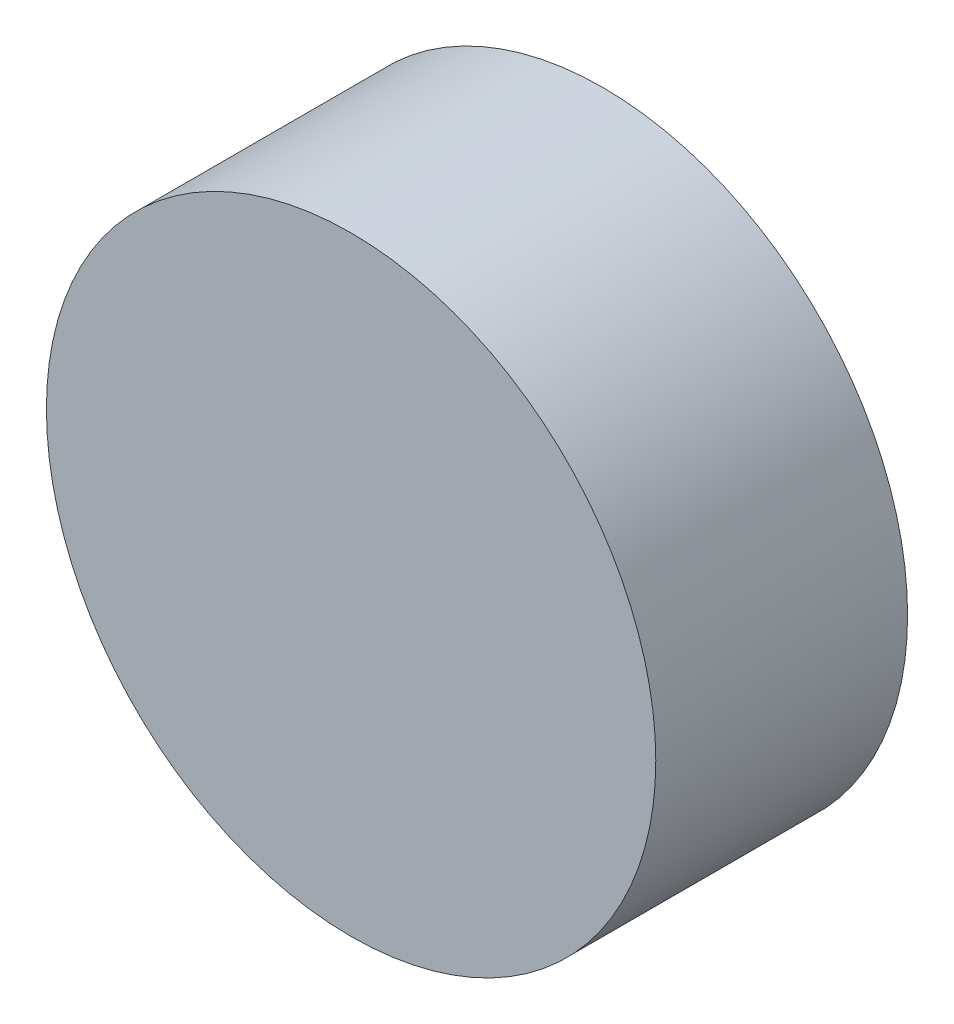
ISO-10303-21;
HEADER;
FILE_DESCRIPTION(('STEP AP214'),'2;1');
FILE_NAME('part.step','',(''),(''),'','','');
FILE_SCHEMA(('AUTOMOTIVE_DESIGN { 1 0 10303 214 1 1 1 1 }'));
ENDSEC;
DATA;
#1=APPLICATION_CONTEXT('core data for automotive mechanical design processes');
#2=APPLICATION_PROTOCOL_DEFINITION('international standard','automotive_design',2000,#1);
#3=PRODUCT_CONTEXT('',#1,'mechanical');
#4=PRODUCT('Part','Part','',(#3));
#5=PRODUCT_RELATED_PRODUCT_CATEGORY('part','',(#4));
#6=PRODUCT_DEFINITION_FORMATION('','',#4);
#7=PRODUCT_DEFINITION_CONTEXT('part definition',#1,'design');
#8=PRODUCT_DEFINITION('design','',#6,#7);
#9=PRODUCT_DEFINITION_SHAPE('','',#8);
#10=(LENGTH_UNIT() NAMED_UNIT(*) SI_UNIT(.MILLI.,.METRE.));
#11=(NAMED_UNIT(*) PLANE_ANGLE_UNIT() SI_UNIT($,.RADIAN.));
#12=(NAMED_UNIT(*) SI_UNIT($,.STERADIAN.) SOLID_ANGLE_UNIT());
#13=UNCERTAINTY_MEASURE_WITH_UNIT(LENGTH_MEASURE(1.E-05),#10,'distance_accuracy_value','');
#14=(GEOMETRIC_REPRESENTATION_CONTEXT(3) GLOBAL_UNCERTAINTY_ASSIGNED_CONTEXT((#13)) GLOBAL_UNIT_ASSIGNED_CONTEXT((#10,
#11,#12)) REPRESENTATION_CONTEXT('',''));
#15=CARTESIAN_POINT('',(0.,0.,0.));
#16=DIRECTION('',(0.,0.,1.));
#17=DIRECTION('',(1.,0.,0.));
#18=AXIS2_PLACEMENT_3D('',#15,#16,#17);
#19=CARTESIAN_POINT('',(0.,0.,2.5));
#20=DIRECTION('',(0.,0.,-1.));
#21=DIRECTION('',(-1.,0.,0.));
#22=AXIS2_PLACEMENT_3D('',#19,#20,#21);
#23=CYLINDRICAL_SURFACE('',#22,3.025);
#24=CARTESIAN_POINT('',(0.,0.,2.5));
#25=DIRECTION('',(0.,0.,1.));
#26=DIRECTION('',(1.,0.,0.));
#27=AXIS2_PLACEMENT_3D('',#24,#25,#26);
#28=CIRCLE('',#27,3.025);
#29=CARTESIAN_POINT('',(3.025,0.,2.5));
#30=VERTEX_POINT('',#29);
#31=EDGE_CURVE('E10',#30,#30,#28,.T.);
#32=ORIENTED_EDGE('',*,*,#31,.F.);
#33=EDGE_LOOP('',(#32));
#34=FACE_BOUND('',#33,.T.);
#35=CARTESIAN_POINT('',(0.,0.,0.));
#36=DIRECTION('',(0.,0.,1.));
#37=DIRECTION('',(1.,0.,0.));
#38=AXIS2_PLACEMENT_3D('',#35,#36,#37);
#39=CIRCLE('',#38,3.025);
#40=CARTESIAN_POINT('',(3.025,0.,0.));
#41=VERTEX_POINT('',#40);
#42=EDGE_CURVE('E33',#41,#41,#39,.T.);
#43=ORIENTED_EDGE('',*,*,#42,.T.);
#44=EDGE_LOOP('',(#43));
#45=FACE_BOUND('',#44,.T.);
#46=ADVANCED_FACE('F30',(#34,#45),#23,.T.);
#47=CARTESIAN_POINT('',(0.,0.,2.5));
#48=DIRECTION('',(0.,0.,1.));
#49=DIRECTION('',(1.,0.,0.));
#50=AXIS2_PLACEMENT_3D('',#47,#48,#49);
#51=PLANE('',#50);
#52=ORIENTED_EDGE('',*,*,#31,.T.);
#53=EDGE_LOOP('',(#52));
#54=FACE_BOUND('',#53,.T.);
#55=ADVANCED_FACE('F45',(#54),#51,.T.);
#56=CARTESIAN_POINT('',(0.,0.,0.));
#57=DIRECTION('',(0.,0.,1.));
#58=DIRECTION('',(1.,0.,0.));
#59=AXIS2_PLACEMENT_3D('',#56,#57,#58);
#60=PLANE('',#59);
#61=ORIENTED_EDGE('',*,*,#42,.F.);
#62=EDGE_LOOP('',(#61));
#63=FACE_BOUND('',#62,.T.);
#64=ADVANCED_FACE('F43',(#63),#60,.F.);
#65=CLOSED_SHELL('',(#46,#55,#64));
#66=MANIFOLD_SOLID_BREP('B2',#65);
#67=ADVANCED_BREP_SHAPE_REPRESENTATION('',(#18,#66),#14);
#68=SHAPE_DEFINITION_REPRESENTATION(#9,#67);
ENDSEC;
END-ISO-10303-21;
